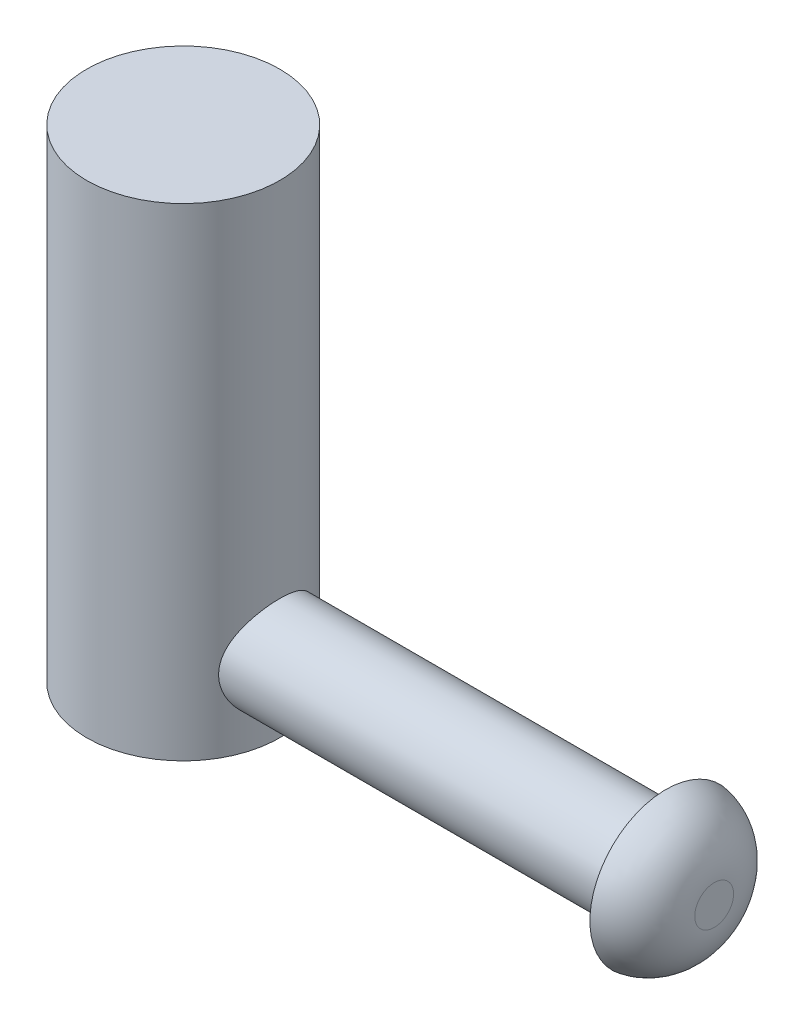
ISO-10303-21;
HEADER;
FILE_DESCRIPTION(('STEP AP214'),'2;1');
FILE_NAME('part.step','',(''),(''),'','','');
FILE_SCHEMA(('AUTOMOTIVE_DESIGN { 1 0 10303 214 1 1 1 1 }'));
ENDSEC;
DATA;
#1=APPLICATION_CONTEXT('core data for automotive mechanical design processes');
#2=APPLICATION_PROTOCOL_DEFINITION('international standard','automotive_design',2000,#1);
#3=PRODUCT_CONTEXT('',#1,'mechanical');
#4=PRODUCT('Part','Part','',(#3));
#5=PRODUCT_RELATED_PRODUCT_CATEGORY('part','',(#4));
#6=PRODUCT_DEFINITION_FORMATION('','',#4);
#7=PRODUCT_DEFINITION_CONTEXT('part definition',#1,'design');
#8=PRODUCT_DEFINITION('design','',#6,#7);
#9=PRODUCT_DEFINITION_SHAPE('','',#8);
#10=(LENGTH_UNIT() NAMED_UNIT(*) SI_UNIT(.MILLI.,.METRE.));
#11=(NAMED_UNIT(*) PLANE_ANGLE_UNIT() SI_UNIT($,.RADIAN.));
#12=(NAMED_UNIT(*) SI_UNIT($,.STERADIAN.) SOLID_ANGLE_UNIT());
#13=UNCERTAINTY_MEASURE_WITH_UNIT(LENGTH_MEASURE(1.E-05),#10,'distance_accuracy_value','');
#14=(GEOMETRIC_REPRESENTATION_CONTEXT(3) GLOBAL_UNCERTAINTY_ASSIGNED_CONTEXT((#13)) GLOBAL_UNIT_ASSIGNED_CONTEXT((#10,
#11,#12)) REPRESENTATION_CONTEXT('',''));
#15=CARTESIAN_POINT('',(0.,0.,0.));
#16=DIRECTION('',(0.,0.,1.));
#17=DIRECTION('',(1.,0.,0.));
#18=AXIS2_PLACEMENT_3D('',#15,#16,#17);
#19=CARTESIAN_POINT('',(0.,127.,0.));
#20=DIRECTION('',(0.,-1.,0.));
#21=DIRECTION('',(0.,0.,-1.));
#22=AXIS2_PLACEMENT_3D('',#19,#20,#21);
#23=CYLINDRICAL_SURFACE('',#22,25.4);
#24=CARTESIAN_POINT('',(21.9970452561247,19.05,-12.7));
#25=CARTESIAN_POINT('',(21.9970471602128,19.3810420807461,-12.6999985647494));
#26=CARTESIAN_POINT('',(22.0045437862155,19.7121130244855,-12.6870391369613));
#27=CARTESIAN_POINT('',(22.0342519284664,20.3717034976564,-12.6353713338878));
#28=CARTESIAN_POINT('',(22.0564702952349,20.7002217672053,-12.5966509711401));
#29=CARTESIAN_POINT('',(22.1148440208644,21.3526264227658,-12.4938849250183));
#30=CARTESIAN_POINT('',(22.1510249211168,21.6765031854515,-12.4297928240411));
#31=CARTESIAN_POINT('',(22.2360170030325,22.316670048592,-12.2770991138377));
#32=CARTESIAN_POINT('',(22.284826974256,22.6329608729521,-12.1884998534566));
#33=CARTESIAN_POINT('',(22.3931480103301,23.2543012598049,-11.9883186278969));
#34=CARTESIAN_POINT('',(22.4525983094468,23.5594033801427,-11.8768666712366));
#35=CARTESIAN_POINT('',(22.5805721347808,24.1586234616995,-11.6317181381331));
#36=CARTESIAN_POINT('',(22.6490991713607,24.4527371165001,-11.4980129502544));
#37=CARTESIAN_POINT('',(22.8653561130759,25.3161442355337,-11.0652401328367));
#38=CARTESIAN_POINT('',(23.0238704837284,25.8670919696492,-10.7343236683619));
#39=CARTESIAN_POINT('',(23.3676412352835,26.953442979612,-9.96516055573082));
#40=CARTESIAN_POINT('',(23.5540249305769,27.4838162959334,-9.5203126301066));
#41=CARTESIAN_POINT('',(23.8309378120557,28.2203478300108,-8.79284622642539));
#42=CARTESIAN_POINT('',(23.9228647991282,28.4561715803135,-8.54011742208882));
#43=CARTESIAN_POINT('',(24.1036457517521,28.9068945224131,-8.01567565449754));
#44=CARTESIAN_POINT('',(24.1925008194246,29.121801269966,-7.7439696076812));
#45=CARTESIAN_POINT('',(24.370853998843,29.5432075794466,-7.16377890210735));
#46=CARTESIAN_POINT('',(24.4599875552318,29.7481502259311,-6.85404964117503));
#47=CARTESIAN_POINT('',(24.6298470545705,30.1310109612756,-6.21607422891501));
#48=CARTESIAN_POINT('',(24.7105725146455,30.3089274983018,-5.88782701577314));
#49=CARTESIAN_POINT('',(24.8612516926925,30.6358915031511,-5.21506652074053));
#50=CARTESIAN_POINT('',(24.9312106298145,30.7849529677731,-4.87056122657622));
#51=CARTESIAN_POINT('',(25.0583005241644,31.0525958823117,-4.16762302685623));
#52=CARTESIAN_POINT('',(25.11543284386,31.1711805697233,-3.80919160530934));
#53=CARTESIAN_POINT('',(25.2115397591581,31.369036569119,-3.10720251540758));
#54=CARTESIAN_POINT('',(25.2515169220277,31.4505044171783,-2.76440059738313));
#55=CARTESIAN_POINT('',(25.3177425338566,31.5848119416637,-2.07192012055632));
#56=CARTESIAN_POINT('',(25.3439915797081,31.637652862779,-1.72224186142015));
#57=CARTESIAN_POINT('',(25.3819888668002,31.7139825733086,-1.01909136302437));
#58=CARTESIAN_POINT('',(25.3937444976109,31.7374863205646,-0.665621149929051));
#59=CARTESIAN_POINT('',(25.4024302708841,31.7548623520299,0.0422200815740275));
#60=CARTESIAN_POINT('',(25.3993613203907,31.7487364491338,0.396591043543345));
#61=CARTESIAN_POINT('',(25.3794055661792,31.7087707869769,1.07234401308664));
#62=CARTESIAN_POINT('',(25.3637453457987,31.6773909089866,1.39391142368825));
#63=CARTESIAN_POINT('',(25.320540629412,31.5903830254822,2.03291731220707));
#64=CARTESIAN_POINT('',(25.2929969701013,31.5347567271201,2.35035607919535));
#65=CARTESIAN_POINT('',(25.2266850381294,31.39986165508,2.97897125371334));
#66=CARTESIAN_POINT('',(25.1879163998152,31.3205921112222,3.29014745688725));
#67=CARTESIAN_POINT('',(25.1000573303477,31.1392170400231,3.90427386213677));
#68=CARTESIAN_POINT('',(25.0509665284666,31.0371106924736,4.20722376831778));
#69=CARTESIAN_POINT('',(24.9428270563849,30.8094553501855,4.80724352433844));
#70=CARTESIAN_POINT('',(24.8836506570485,30.6836031085568,5.1041750988441));
#71=CARTESIAN_POINT('',(24.7571386689521,30.4104823246213,5.68619260071747));
#72=CARTESIAN_POINT('',(24.6898030899667,30.2632138079709,5.9712785422755));
#73=CARTESIAN_POINT('',(24.5484061586244,29.9483499085496,6.52827145034378));
#74=CARTESIAN_POINT('',(24.4743441844574,29.7807526460411,6.80017719486261));
#75=CARTESIAN_POINT('',(24.321008981523,29.4262720280837,7.32970282693975));
#76=CARTESIAN_POINT('',(24.241733732656,29.2393811803602,7.58731710454069));
#77=CARTESIAN_POINT('',(24.0719525020219,28.8289077346986,8.1107189326513));
#78=CARTESIAN_POINT('',(23.9810927057987,28.6035269187307,8.37498325169425));
#79=CARTESIAN_POINT('',(23.7972913728668,28.1322983961376,8.88381203754073));
#80=CARTESIAN_POINT('',(23.7043497188136,27.8864495336934,9.12837539030551));
#81=CARTESIAN_POINT('',(23.5186138315105,27.3753768985287,9.59678718723074));
#82=CARTESIAN_POINT('',(23.4258197341869,27.1101405767493,9.82062199798168));
#83=CARTESIAN_POINT('',(23.2427999635405,26.561630821775,10.2462645447203));
#84=CARTESIAN_POINT('',(23.1525747518022,26.2783541762739,10.4480683403477));
#85=CARTESIAN_POINT('',(22.9715514343696,25.6764402643528,10.8405474751142));
#86=CARTESIAN_POINT('',(22.8810846524641,25.3567000961703,11.0296893051339));
#87=CARTESIAN_POINT('',(22.7088984125069,24.7001621973306,11.3799836986017));
#88=CARTESIAN_POINT('',(22.6271749714927,24.3633723374261,11.5411490275416));
#89=CARTESIAN_POINT('',(22.4754617527209,23.6748286806348,11.8338838194025));
#90=CARTESIAN_POINT('',(22.4054650808563,23.3230838293027,11.9654706870086));
#91=CARTESIAN_POINT('',(22.2799865885559,22.6069602897252,12.1975260044049));
#92=CARTESIAN_POINT('',(22.2245027890992,22.242583331716,12.2979986973657));
#93=CARTESIAN_POINT('',(22.1342262843656,21.5334790141535,12.4596912887769));
#94=CARTESIAN_POINT('',(22.098142911759,21.1894808921785,12.5233897061292));
#95=CARTESIAN_POINT('',(22.0418220540794,20.4961162926004,12.6222558976789));
#96=CARTESIAN_POINT('',(22.0215836735453,20.1467501195044,12.6574252841648));
#97=CARTESIAN_POINT('',(21.9978227828486,19.4459470423252,12.6986756625791));
#98=CARTESIAN_POINT('',(21.994290174051,19.0945115178566,12.7047742278297));
#99=CARTESIAN_POINT('',(22.0040693445831,18.392593499876,12.6878302022715));
#100=CARTESIAN_POINT('',(22.0173799869267,18.0421109436354,12.6647895784734));
#101=CARTESIAN_POINT('',(22.0579043046366,17.3835445009991,12.5940573760551));
#102=CARTESIAN_POINT('',(22.0834315216201,17.0750295052712,12.5493492475133));
#103=CARTESIAN_POINT('',(22.1465318454431,16.4632099329642,12.4376541859353));
#104=CARTESIAN_POINT('',(22.184108940291,16.1599071164627,12.3706598768256));
#105=CARTESIAN_POINT('',(22.2701258086824,15.5605171053264,12.215128963231));
#106=CARTESIAN_POINT('',(22.3185641324,15.2644289534753,12.1265952338312));
#107=CARTESIAN_POINT('',(22.4249117667195,14.6809014913133,11.9287859618344));
#108=CARTESIAN_POINT('',(22.4828248323198,14.3934656637554,11.8195021928819));
#109=CARTESIAN_POINT('',(22.6093845553946,13.8157553865419,11.5756402427838));
#110=CARTESIAN_POINT('',(22.6784016201461,13.5259551192354,11.4401320002685));
#111=CARTESIAN_POINT('',(22.8232288817731,12.9586078091804,11.1483965411298));
#112=CARTESIAN_POINT('',(22.8990419788175,12.6810660738329,10.9921604652366));
#113=CARTESIAN_POINT('',(23.0555590560225,12.1394250404758,10.6599674616086));
#114=CARTESIAN_POINT('',(23.1362640138934,11.875328449211,10.4840065855742));
#115=CARTESIAN_POINT('',(23.3006827313257,11.3616293649374,10.113322779748));
#116=CARTESIAN_POINT('',(23.3843967051249,11.1120279072843,9.91859851236337));
#117=CARTESIAN_POINT('',(23.5636645058326,10.5976922140596,9.4855329974286));
#118=CARTESIAN_POINT('',(23.6593777533432,10.3350312258121,9.2447894502468));
#119=CARTESIAN_POINT('',(23.8497410423583,9.83074538024891,8.74197321743339));
#120=CARTESIAN_POINT('',(23.9443913904567,9.58911431363089,8.47990687209977));
#121=CARTESIAN_POINT('',(24.1302993318609,9.12800953049297,7.93545520062454));
#122=CARTESIAN_POINT('',(24.2215543349948,8.90855251925937,7.65305482570265));
#123=CARTESIAN_POINT('',(24.3982173985347,8.49356827963927,7.06964182281789));
#124=CARTESIAN_POINT('',(24.4836279404689,8.29803086698485,6.76863719875104));
#125=CARTESIAN_POINT('',(24.6485996720327,7.92742205617927,6.14121491873794));
#126=CARTESIAN_POINT('',(24.7279432691808,7.75303806015415,5.81433284669376));
#127=CARTESIAN_POINT('',(24.8759160322661,7.43271184087587,5.14455133013142));
#128=CARTESIAN_POINT('',(24.9445448390965,7.28677057084116,4.80165134927256));
#129=CARTESIAN_POINT('',(25.0690086800244,7.02509088055367,4.10253106573799));
#130=CARTESIAN_POINT('',(25.1248528498603,6.9093308848819,3.74632048771279));
#131=CARTESIAN_POINT('',(25.2220758898254,6.70938578449528,3.02322650574832));
#132=CARTESIAN_POINT('',(25.2634564752322,6.625196935582,2.65634437297284));
#133=CARTESIAN_POINT('',(25.3273539195209,6.49580929596041,1.94920235554088));
#134=CARTESIAN_POINT('',(25.3512536510551,6.44774089246716,1.60959001490067));
#135=CARTESIAN_POINT('',(25.3853816074126,6.37922689235229,0.926912035885021));
#136=CARTESIAN_POINT('',(25.3956106999074,6.35877954262954,0.583846618068023));
#137=CARTESIAN_POINT('',(25.4021120060045,6.34577535186779,-0.102839446284004));
#138=CARTESIAN_POINT('',(25.3983883777696,6.35321020143045,-0.446459896899585));
#139=CARTESIAN_POINT('',(25.3770971994885,6.3958542023007,-1.13153389091492));
#140=CARTESIAN_POINT('',(25.3595300305546,6.4310625890036,-1.47298749370707));
#141=CARTESIAN_POINT('',(25.3126435066068,6.52556490034316,-2.12858527568835));
#142=CARTESIAN_POINT('',(25.2841765669811,6.58311530426898,-2.44304419112651));
#143=CARTESIAN_POINT('',(25.2162691565626,6.72142103246127,-3.0655837436746));
#144=CARTESIAN_POINT('',(25.1768293052811,6.80217504670158,-3.3736647398158));
#145=CARTESIAN_POINT('',(25.0878735123424,6.9860922027362,-3.98158173319984));
#146=CARTESIAN_POINT('',(25.0383567873887,7.08925708661679,-4.28141708743362));
#147=CARTESIAN_POINT('',(24.9303397913062,7.31705941391041,-4.87114333181489));
#148=CARTESIAN_POINT('',(24.8718391009164,7.44169785947861,-5.16103375708247));
#149=CARTESIAN_POINT('',(24.7444293333949,7.71720104299412,-5.74153755123178));
#150=CARTESIAN_POINT('',(24.6751823649851,7.86895872813089,-6.03165271619898));
#151=CARTESIAN_POINT('',(24.5298098520684,8.19354461094811,-6.59802427573064));
#152=CARTESIAN_POINT('',(24.4536841788377,8.3663732029571,-6.87428041079562));
#153=CARTESIAN_POINT('',(24.2961802971371,8.73197718704439,-7.41175170677076));
#154=CARTESIAN_POINT('',(24.2148010722428,8.92475644342996,-7.67296393847169));
#155=CARTESIAN_POINT('',(24.0484958467777,9.32919030921192,-8.17929680023456));
#156=CARTESIAN_POINT('',(23.9635684730117,9.54085226320227,-8.42441110393882));
#157=CARTESIAN_POINT('',(23.7834500990398,10.0038737885493,-8.92098717319141));
#158=CARTESIAN_POINT('',(23.688078153342,10.2570879541916,-9.17065712465206));
#159=CARTESIAN_POINT('',(23.4977167440241,10.783626008772,-9.64797087813653));
#160=CARTESIAN_POINT('',(23.4027272917455,11.0569504894491,-9.87561403157303));
#161=CARTESIAN_POINT('',(23.2156147898567,11.6226144173546,-10.3077994956351));
#162=CARTESIAN_POINT('',(23.123494190191,11.914969491805,-10.5123224338757));
#163=CARTESIAN_POINT('',(22.9448378372625,12.5171405545823,-10.896759382453));
#164=CARTESIAN_POINT('',(22.858302987056,12.826959351203,-11.0766694188231));
#165=CARTESIAN_POINT('',(22.6908951069765,13.4726363779299,-11.4157868639676));
#166=CARTESIAN_POINT('',(22.6102916419609,13.8090104904963,-11.5741482082511));
#167=CARTESIAN_POINT('',(22.4609070473123,14.4964526984344,-11.8614454203001));
#168=CARTESIAN_POINT('',(22.3921197744437,14.847513039658,-11.9903965899069));
#169=CARTESIAN_POINT('',(22.2692493503278,15.5610701147008,-12.2170838217044));
#170=CARTESIAN_POINT('',(22.2151284619609,15.9235347671628,-12.3149001105845));
#171=CARTESIAN_POINT('',(22.1237750343668,16.6575556131312,-12.4782771120638));
#172=CARTESIAN_POINT('',(22.0865306888318,17.0291052586806,-12.5438603766174));
#173=CARTESIAN_POINT('',(22.0382476199109,17.675854352842,-12.6284304598707));
#174=CARTESIAN_POINT('',(22.0228342714581,17.9497333710954,-12.6552434069377));
#175=CARTESIAN_POINT('',(22.0022319553292,18.4990681944843,-12.6910293708987));
#176=CARTESIAN_POINT('',(21.9970436716423,18.7745241038674,-12.7000011943404));
#177=CARTESIAN_POINT('',(21.9970452561247,19.05,-12.7));
#178=B_SPLINE_CURVE_WITH_KNOTS('',3,(#24,#25,#26,#27,#28,#29,#30,#31,#32,#33,#34,#35,#36,#37,
#38,#39,#40,#41,#42,#43,#44,#45,#46,#47,#48,#49,#50,#51,#52,#53,#54,#55,#56,#57,#58,#59,#60,#61,
#62,#63,#64,#65,#66,#67,#68,#69,#70,#71,#72,#73,#74,#75,#76,#77,#78,#79,#80,#81,#82,#83,#84,#85,
#86,#87,#88,#89,#90,#91,#92,#93,#94,#95,#96,#97,#98,#99,#100,#101,#102,#103,#104,#105,#106,#107,
#108,#109,#110,#111,#112,#113,#114,#115,#116,#117,#118,#119,#120,#121,#122,#123,#124,#125,#126,
#127,#128,#129,#130,#131,#132,#133,#134,#135,#136,#137,#138,#139,#140,#141,#142,#143,#144,#145,
#146,#147,#148,#149,#150,#151,#152,#153,#154,#155,#156,#157,#158,#159,#160,#161,#162,#163,#164,
#165,#166,#167,#168,#169,#170,#171,#172,#173,#174,#175,#176,#177),.UNSPECIFIED.,.T.,.F.,(4,2,2,
2,2,2,2,2,2,2,2,2,2,2,2,2,2,2,2,2,2,2,2,2,2,2,2,2,2,2,2,2,2,2,2,2,2,2,2,2,2,2,2,2,2,2,2,2,2,2,2,
2,2,2,2,2,2,2,2,2,2,2,2,2,2,2,2,2,2,2,2,2,2,2,2,2,4),(0.,0.992841256773457,1.98614484069135,
2.98127413516308,3.97630808626216,4.96583099917635,5.95573772646566,7.93368817155649,
10.0747759271307,11.1468942610208,12.218623869757,13.3629886651861,14.5074191449963,
15.6512930944215,16.7950454818372,17.857435006988,18.9197783360939,19.9815797976435,
21.0433162935313,22.0125928506763,22.9818011736155,23.9510410720043,24.9203157872719,
25.9029281283044,26.8855392921968,27.8682413845279,28.8513265352096,29.9271929305077,
31.0031201206287,32.0797500083507,33.1565721424736,34.3021563419872,35.4472164371095,
36.5916009769249,37.7358293834202,38.789438498316,39.8429880654364,40.8959006806151,
41.9487422238141,42.886017324986,43.8236029459353,44.7610634864151,45.6988964621831,
46.6797322342173,47.6609885833768,48.6424417018712,49.623964837417,50.7295147964185,
51.8347372150265,52.9407861630636,54.0463625363864,55.1815136853403,56.3167028707683,
57.4510783146944,58.5853191841304,59.6154461363638,60.6455077036341,61.675262318375,
62.7049885849902,63.6667347316751,64.6284265908971,65.5901932330307,66.5520047722631,
67.5549064405592,68.5578268804,69.5609419439473,70.5644488935119,71.6677265518938,
72.7710366868203,73.8752645363012,74.9796704630673,76.1193951815199,77.2585255520905,
78.3946964541357,79.5300712943583,80.3562065716749,81.1823971100821),.UNSPECIFIED.);
#179=CARTESIAN_POINT('',(21.9970452561247,19.05,-12.7));
#180=VERTEX_POINT('',#179);
#181=EDGE_CURVE('E53',#180,#180,#178,.T.);
#182=ORIENTED_EDGE('',*,*,#181,.F.);
#183=EDGE_LOOP('',(#182));
#184=FACE_BOUND('',#183,.T.);
#185=CARTESIAN_POINT('',(0.,127.,0.));
#186=DIRECTION('',(0.,1.,0.));
#187=DIRECTION('',(0.,0.,1.));
#188=AXIS2_PLACEMENT_3D('',#185,#186,#187);
#189=CIRCLE('',#188,25.4);
#190=CARTESIAN_POINT('',(0.,127.,25.4));
#191=VERTEX_POINT('',#190);
#192=EDGE_CURVE('E44',#191,#191,#189,.T.);
#193=ORIENTED_EDGE('',*,*,#192,.F.);
#194=EDGE_LOOP('',(#193));
#195=FACE_BOUND('',#194,.T.);
#196=CARTESIAN_POINT('',(0.,0.,0.));
#197=DIRECTION('',(0.,1.,0.));
#198=DIRECTION('',(0.,0.,1.));
#199=AXIS2_PLACEMENT_3D('',#196,#197,#198);
#200=CIRCLE('',#199,25.4);
#201=CARTESIAN_POINT('',(0.,0.,25.4));
#202=VERTEX_POINT('',#201);
#203=EDGE_CURVE('E48',#202,#202,#200,.T.);
#204=ORIENTED_EDGE('',*,*,#203,.T.);
#205=EDGE_LOOP('',(#204));
#206=FACE_BOUND('',#205,.T.);
#207=ADVANCED_FACE('F37',(#184,#195,#206),#23,.T.);
#208=CARTESIAN_POINT('',(0.,127.,0.));
#209=DIRECTION('',(0.,1.,0.));
#210=DIRECTION('',(0.,0.,1.));
#211=AXIS2_PLACEMENT_3D('',#208,#209,#210);
#212=PLANE('',#211);
#213=ORIENTED_EDGE('',*,*,#192,.T.);
#214=EDGE_LOOP('',(#213));
#215=FACE_BOUND('',#214,.T.);
#216=ADVANCED_FACE('F81',(#215),#212,.T.);
#217=CARTESIAN_POINT('',(0.,0.,0.));
#218=DIRECTION('',(0.,1.,0.));
#219=DIRECTION('',(0.,0.,1.));
#220=AXIS2_PLACEMENT_3D('',#217,#218,#219);
#221=PLANE('',#220);
#222=ORIENTED_EDGE('',*,*,#203,.F.);
#223=EDGE_LOOP('',(#222));
#224=FACE_BOUND('',#223,.T.);
#225=ADVANCED_FACE('F78',(#224),#221,.F.);
#226=CARTESIAN_POINT('',(-25.401,19.05,0.));
#227=DIRECTION('',(1.,0.,0.));
#228=DIRECTION('',(0.,0.,-1.));
#229=AXIS2_PLACEMENT_3D('',#226,#227,#228);
#230=CYLINDRICAL_SURFACE('',#229,12.7);
#231=CARTESIAN_POINT('',(127.,19.05,0.));
#232=DIRECTION('',(1.,0.,0.));
#233=DIRECTION('',(0.,0.,-1.));
#234=AXIS2_PLACEMENT_3D('',#231,#232,#233);
#235=CIRCLE('',#234,12.7);
#236=CARTESIAN_POINT('',(127.,19.05,-12.7));
#237=VERTEX_POINT('',#236);
#238=EDGE_CURVE('E62',#237,#237,#235,.T.);
#239=ORIENTED_EDGE('',*,*,#238,.F.);
#240=EDGE_LOOP('',(#239));
#241=FACE_BOUND('',#240,.T.);
#242=ORIENTED_EDGE('',*,*,#181,.T.);
#243=EDGE_LOOP('',(#242));
#244=FACE_BOUND('',#243,.T.);
#245=ADVANCED_FACE('F64',(#241,#244),#230,.T.);
#246=CARTESIAN_POINT('',(139.7,19.05,0.));
#247=DIRECTION('',(1.,0.,0.));
#248=DIRECTION('',(0.,0.,-1.));
#249=AXIS2_PLACEMENT_3D('',#246,#247,#248);
#250=PLANE('',#249);
#251=CARTESIAN_POINT('',(139.7,19.05,0.));
#252=DIRECTION('',(1.,0.,0.));
#253=DIRECTION('',(0.,0.,-1.));
#254=AXIS2_PLACEMENT_3D('',#251,#252,#253);
#255=CIRCLE('',#254,5.10899600429844);
#256=CARTESIAN_POINT('',(139.7,19.05,-5.10899600429844));
#257=VERTEX_POINT('',#256);
#258=EDGE_CURVE('E10',#257,#257,#255,.T.);
#259=ORIENTED_EDGE('',*,*,#258,.T.);
#260=EDGE_LOOP('',(#259));
#261=FACE_BOUND('',#260,.T.);
#262=ADVANCED_FACE('F72',(#261),#250,.T.);
#263=CARTESIAN_POINT('',(127.,19.05,0.));
#264=DIRECTION('',(1.,0.,0.));
#265=DIRECTION('',(0.,0.,-1.));
#266=AXIS2_PLACEMENT_3D('',#263,#264,#265);
#267=PLANE('',#266);
#268=ORIENTED_EDGE('',*,*,#238,.T.);
#269=EDGE_LOOP('',(#268));
#270=FACE_BOUND('',#269,.T.);
#271=CARTESIAN_POINT('',(127.,19.05,0.));
#272=DIRECTION('',(1.,0.,0.));
#273=DIRECTION('',(0.,0.,-1.));
#274=AXIS2_PLACEMENT_3D('',#271,#272,#273);
#275=CIRCLE('',#274,20.);
#276=CARTESIAN_POINT('',(127.,19.05,-20.));
#277=VERTEX_POINT('',#276);
#278=EDGE_CURVE('E126',#277,#277,#275,.T.);
#279=ORIENTED_EDGE('',*,*,#278,.F.);
#280=EDGE_LOOP('',(#279));
#281=FACE_BOUND('',#280,.T.);
#282=ADVANCED_FACE('F69',(#270,#281),#267,.F.);
#283=CARTESIAN_POINT('',(124.62,19.05,0.));
#284=DIRECTION('',(-1.,0.,0.));
#285=DIRECTION('',(0.,0.,1.));
#286=AXIS2_PLACEMENT_3D('',#283,#284,#285);
#287=DEGENERATE_TOROIDAL_SURFACE('',#286,5.10899600429844,15.08,.T.);
#288=ORIENTED_EDGE('',*,*,#278,.T.);
#289=EDGE_LOOP('',(#288));
#290=FACE_BOUND('',#289,.T.);
#291=ORIENTED_EDGE('',*,*,#258,.F.);
#292=EDGE_LOOP('',(#291));
#293=FACE_BOUND('',#292,.T.);
#294=ADVANCED_FACE('F39',(#290,#293),#287,.T.);
#295=CLOSED_SHELL('',(#207,#216,#225,#245,#262,#282,#294));
#296=MANIFOLD_SOLID_BREP('B2',#295);
#297=ADVANCED_BREP_SHAPE_REPRESENTATION('',(#18,#296),#14);
#298=SHAPE_DEFINITION_REPRESENTATION(#9,#297);
ENDSEC;
END-ISO-10303-21;
